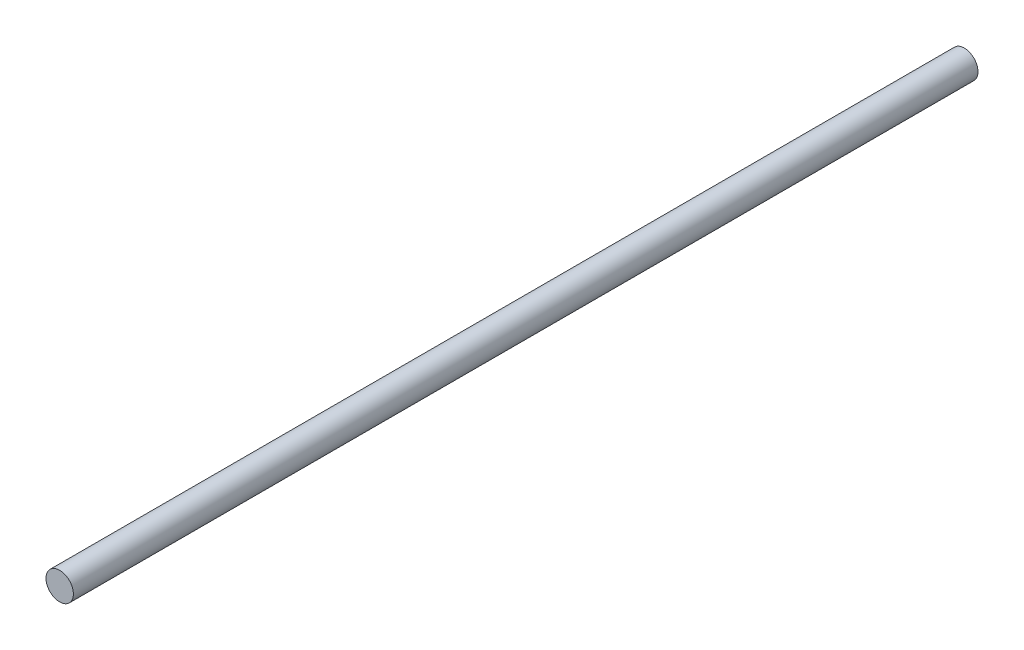
ISO-10303-21;
HEADER;
FILE_DESCRIPTION(('STEP AP214'),'2;1');
FILE_NAME('part.step','',(''),(''),'','','');
FILE_SCHEMA(('AUTOMOTIVE_DESIGN { 1 0 10303 214 1 1 1 1 }'));
ENDSEC;
DATA;
#1=APPLICATION_CONTEXT('core data for automotive mechanical design processes');
#2=APPLICATION_PROTOCOL_DEFINITION('international standard','automotive_design',2000,#1);
#3=PRODUCT_CONTEXT('',#1,'mechanical');
#4=PRODUCT('Part','Part','',(#3));
#5=PRODUCT_RELATED_PRODUCT_CATEGORY('part','',(#4));
#6=PRODUCT_DEFINITION_FORMATION('','',#4);
#7=PRODUCT_DEFINITION_CONTEXT('part definition',#1,'design');
#8=PRODUCT_DEFINITION('design','',#6,#7);
#9=PRODUCT_DEFINITION_SHAPE('','',#8);
#10=(LENGTH_UNIT() NAMED_UNIT(*) SI_UNIT(.MILLI.,.METRE.));
#11=(NAMED_UNIT(*) PLANE_ANGLE_UNIT() SI_UNIT($,.RADIAN.));
#12=(NAMED_UNIT(*) SI_UNIT($,.STERADIAN.) SOLID_ANGLE_UNIT());
#13=UNCERTAINTY_MEASURE_WITH_UNIT(LENGTH_MEASURE(1.E-05),#10,'distance_accuracy_value','');
#14=(GEOMETRIC_REPRESENTATION_CONTEXT(3) GLOBAL_UNCERTAINTY_ASSIGNED_CONTEXT((#13)) GLOBAL_UNIT_ASSIGNED_CONTEXT((#10,
#11,#12)) REPRESENTATION_CONTEXT('',''));
#15=CARTESIAN_POINT('',(0.,0.,0.));
#16=DIRECTION('',(0.,0.,1.));
#17=DIRECTION('',(1.,0.,0.));
#18=AXIS2_PLACEMENT_3D('',#15,#16,#17);
#19=CARTESIAN_POINT('',(0.,0.,165.));
#20=DIRECTION('',(0.,0.,-1.));
#21=DIRECTION('',(-1.,0.,0.));
#22=AXIS2_PLACEMENT_3D('',#19,#20,#21);
#23=CYLINDRICAL_SURFACE('',#22,2.5);
#24=CARTESIAN_POINT('',(0.,0.,165.));
#25=DIRECTION('',(0.,0.,1.));
#26=DIRECTION('',(1.,0.,0.));
#27=AXIS2_PLACEMENT_3D('',#24,#25,#26);
#28=CIRCLE('',#27,2.5);
#29=CARTESIAN_POINT('',(2.5,0.,165.));
#30=VERTEX_POINT('',#29);
#31=EDGE_CURVE('E10',#30,#30,#28,.T.);
#32=ORIENTED_EDGE('',*,*,#31,.F.);
#33=EDGE_LOOP('',(#32));
#34=FACE_BOUND('',#33,.T.);
#35=CARTESIAN_POINT('',(0.,0.,0.));
#36=DIRECTION('',(0.,0.,1.));
#37=DIRECTION('',(1.,0.,0.));
#38=AXIS2_PLACEMENT_3D('',#35,#36,#37);
#39=CIRCLE('',#38,2.5);
#40=CARTESIAN_POINT('',(2.5,0.,0.));
#41=VERTEX_POINT('',#40);
#42=EDGE_CURVE('E32',#41,#41,#39,.T.);
#43=ORIENTED_EDGE('',*,*,#42,.T.);
#44=EDGE_LOOP('',(#43));
#45=FACE_BOUND('',#44,.T.);
#46=ADVANCED_FACE('F29',(#34,#45),#23,.T.);
#47=CARTESIAN_POINT('',(0.,0.,165.));
#48=DIRECTION('',(0.,0.,1.));
#49=DIRECTION('',(1.,0.,0.));
#50=AXIS2_PLACEMENT_3D('',#47,#48,#49);
#51=PLANE('',#50);
#52=ORIENTED_EDGE('',*,*,#31,.T.);
#53=EDGE_LOOP('',(#52));
#54=FACE_BOUND('',#53,.T.);
#55=ADVANCED_FACE('F44',(#54),#51,.T.);
#56=CARTESIAN_POINT('',(0.,0.,0.));
#57=DIRECTION('',(0.,0.,1.));
#58=DIRECTION('',(1.,0.,0.));
#59=AXIS2_PLACEMENT_3D('',#56,#57,#58);
#60=PLANE('',#59);
#61=ORIENTED_EDGE('',*,*,#42,.F.);
#62=EDGE_LOOP('',(#61));
#63=FACE_BOUND('',#62,.T.);
#64=ADVANCED_FACE('F42',(#63),#60,.F.);
#65=CLOSED_SHELL('',(#46,#55,#64));
#66=MANIFOLD_SOLID_BREP('B2',#65);
#67=ADVANCED_BREP_SHAPE_REPRESENTATION('',(#18,#66),#14);
#68=SHAPE_DEFINITION_REPRESENTATION(#9,#67);
ENDSEC;
END-ISO-10303-21;
